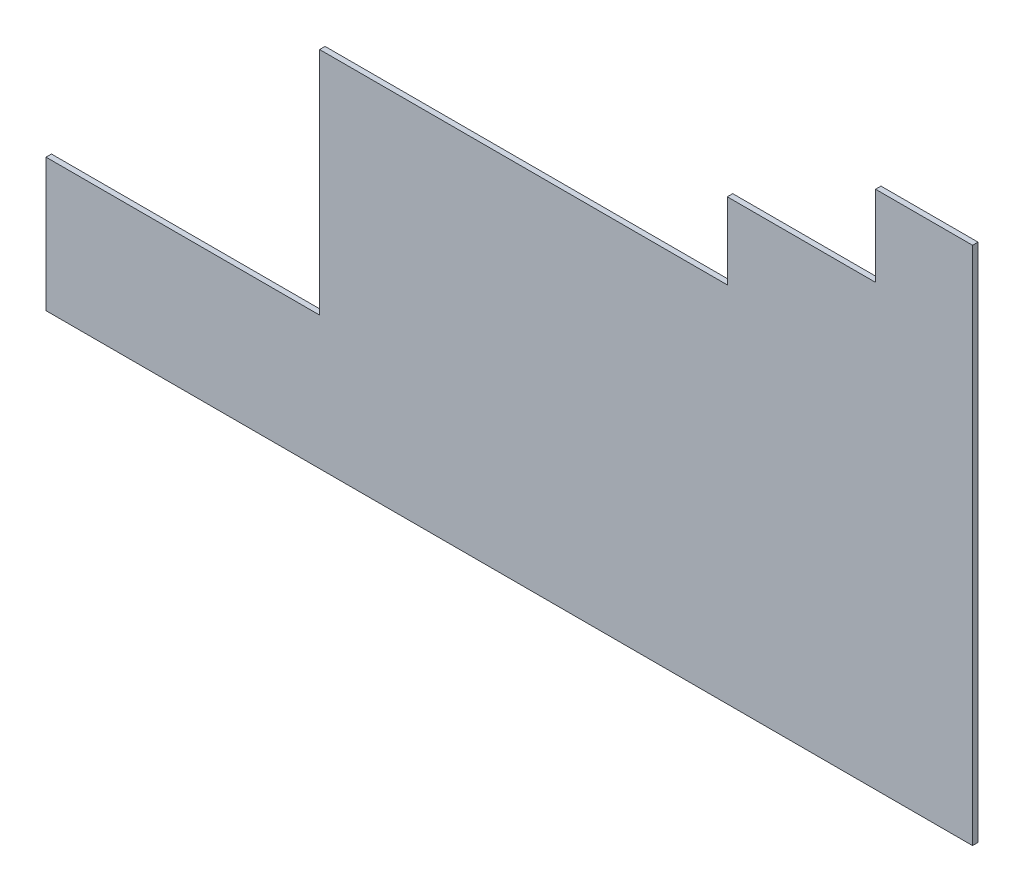
ISO-10303-21;
HEADER;
FILE_DESCRIPTION(('STEP AP214'),'2;1');
FILE_NAME('part.step','',(''),(''),'','','');
FILE_SCHEMA(('AUTOMOTIVE_DESIGN { 1 0 10303 214 1 1 1 1 }'));
ENDSEC;
DATA;
#1=APPLICATION_CONTEXT('core data for automotive mechanical design processes');
#2=APPLICATION_PROTOCOL_DEFINITION('international standard','automotive_design',2000,#1);
#3=PRODUCT_CONTEXT('',#1,'mechanical');
#4=PRODUCT('Part','Part','',(#3));
#5=PRODUCT_RELATED_PRODUCT_CATEGORY('part','',(#4));
#6=PRODUCT_DEFINITION_FORMATION('','',#4);
#7=PRODUCT_DEFINITION_CONTEXT('part definition',#1,'design');
#8=PRODUCT_DEFINITION('design','',#6,#7);
#9=PRODUCT_DEFINITION_SHAPE('','',#8);
#10=(LENGTH_UNIT() NAMED_UNIT(*) SI_UNIT(.MILLI.,.METRE.));
#11=(NAMED_UNIT(*) PLANE_ANGLE_UNIT() SI_UNIT($,.RADIAN.));
#12=(NAMED_UNIT(*) SI_UNIT($,.STERADIAN.) SOLID_ANGLE_UNIT());
#13=UNCERTAINTY_MEASURE_WITH_UNIT(LENGTH_MEASURE(1.E-05),#10,'distance_accuracy_value','');
#14=(GEOMETRIC_REPRESENTATION_CONTEXT(3) GLOBAL_UNCERTAINTY_ASSIGNED_CONTEXT((#13)) GLOBAL_UNIT_ASSIGNED_CONTEXT((#10,
#11,#12)) REPRESENTATION_CONTEXT('',''));
#15=CARTESIAN_POINT('',(0.,0.,0.));
#16=DIRECTION('',(0.,0.,1.));
#17=DIRECTION('',(1.,0.,0.));
#18=AXIS2_PLACEMENT_3D('',#15,#16,#17);
#19=CARTESIAN_POINT('',(0.,0.,-25.));
#20=DIRECTION('',(0.,0.,-1.));
#21=DIRECTION('',(-1.,0.,0.));
#22=AXIS2_PLACEMENT_3D('',#19,#20,#21);
#23=PLANE('',#22);
#24=DIRECTION('',(1.,0.,0.));
#25=VECTOR('',#24,1.);
#26=CARTESIAN_POINT('',(0.,4.99999999999962,-25.));
#27=LINE('',#26,#25);
#28=CARTESIAN_POINT('',(1405.,5.00000000000006,-25.));
#29=VERTEX_POINT('',#28);
#30=CARTESIAN_POINT('',(5655.,5.00000000000032,-25.));
#31=VERTEX_POINT('',#30);
#32=EDGE_CURVE('E118',#29,#31,#27,.T.);
#33=ORIENTED_EDGE('',*,*,#32,.F.);
#34=DIRECTION('',(0.,1.,0.));
#35=VECTOR('',#34,1.);
#36=CARTESIAN_POINT('',(1405.,0.,-25.));
#37=LINE('',#36,#35);
#38=CARTESIAN_POINT('',(1405.,615.,-25.));
#39=VERTEX_POINT('',#38);
#40=EDGE_CURVE('E128',#29,#39,#37,.T.);
#41=ORIENTED_EDGE('',*,*,#40,.T.);
#42=DIRECTION('',(-1.,0.,0.));
#43=VECTOR('',#42,1.);
#44=CARTESIAN_POINT('',(0.,615.,-25.));
#45=LINE('',#44,#43);
#46=CARTESIAN_POINT('',(2660.,615.,-25.));
#47=VERTEX_POINT('',#46);
#48=EDGE_CURVE('E138',#47,#39,#45,.T.);
#49=ORIENTED_EDGE('',*,*,#48,.F.);
#50=DIRECTION('',(0.,1.,0.));
#51=VECTOR('',#50,1.);
#52=CARTESIAN_POINT('',(2660.,0.,-25.));
#53=LINE('',#52,#51);
#54=CARTESIAN_POINT('',(2660.,1670.,-25.));
#55=VERTEX_POINT('',#54);
#56=EDGE_CURVE('E139',#47,#55,#53,.T.);
#57=ORIENTED_EDGE('',*,*,#56,.T.);
#58=DIRECTION('',(1.,0.,0.));
#59=VECTOR('',#58,1.);
#60=CARTESIAN_POINT('',(4300.,1670.,-25.));
#61=LINE('',#60,#59);
#62=CARTESIAN_POINT('',(4530.,1670.,-25.));
#63=VERTEX_POINT('',#62);
#64=EDGE_CURVE('E163',#55,#63,#61,.T.);
#65=ORIENTED_EDGE('',*,*,#64,.T.);
#66=DIRECTION('',(0.,1.,0.));
#67=VECTOR('',#66,1.);
#68=CARTESIAN_POINT('',(4530.,1670.,-25.));
#69=LINE('',#68,#67);
#70=CARTESIAN_POINT('',(4530.,2020.,-25.));
#71=VERTEX_POINT('',#70);
#72=EDGE_CURVE('E141',#63,#71,#69,.T.);
#73=ORIENTED_EDGE('',*,*,#72,.T.);
#74=DIRECTION('',(-1.,0.,0.));
#75=VECTOR('',#74,1.);
#76=CARTESIAN_POINT('',(2935.,2020.,-25.));
#77=LINE('',#76,#75);
#78=CARTESIAN_POINT('',(5210.,2020.,-25.));
#79=VERTEX_POINT('',#78);
#80=EDGE_CURVE('E177',#79,#71,#77,.T.);
#81=ORIENTED_EDGE('',*,*,#80,.F.);
#82=DIRECTION('',(0.,1.,0.));
#83=VECTOR('',#82,1.);
#84=CARTESIAN_POINT('',(5210.,2515.,-25.));
#85=LINE('',#84,#83);
#86=CARTESIAN_POINT('',(5210.,2390.,-25.));
#87=VERTEX_POINT('',#86);
#88=EDGE_CURVE('E186',#79,#87,#85,.T.);
#89=ORIENTED_EDGE('',*,*,#88,.T.);
#90=DIRECTION('',(1.,0.,0.));
#91=VECTOR('',#90,1.);
#92=CARTESIAN_POINT('',(5210.,2390.,-25.));
#93=LINE('',#92,#91);
#94=CARTESIAN_POINT('',(5655.,2390.,-25.));
#95=VERTEX_POINT('',#94);
#96=EDGE_CURVE('E149',#87,#95,#93,.T.);
#97=ORIENTED_EDGE('',*,*,#96,.T.);
#98=DIRECTION('',(0.,1.,0.));
#99=VECTOR('',#98,1.);
#100=CARTESIAN_POINT('',(5655.,0.,-25.));
#101=LINE('',#100,#99);
#102=EDGE_CURVE('E131',#31,#95,#101,.T.);
#103=ORIENTED_EDGE('',*,*,#102,.F.);
#104=EDGE_LOOP('',(#33,#41,#49,#57,#65,#73,#81,#89,#97,#103));
#105=FACE_BOUND('',#104,.T.);
#106=ADVANCED_FACE('F40',(#105),#23,.T.);
#107=CARTESIAN_POINT('',(0.,0.,0.));
#108=DIRECTION('',(0.,0.,-1.));
#109=DIRECTION('',(-1.,0.,0.));
#110=AXIS2_PLACEMENT_3D('',#107,#108,#109);
#111=PLANE('',#110);
#112=DIRECTION('',(0.,1.,0.));
#113=VECTOR('',#112,1.);
#114=CARTESIAN_POINT('',(1405.,0.,0.));
#115=LINE('',#114,#113);
#116=CARTESIAN_POINT('',(1405.,4.9999999999998,0.));
#117=VERTEX_POINT('',#116);
#118=CARTESIAN_POINT('',(1405.,615.,0.));
#119=VERTEX_POINT('',#118);
#120=EDGE_CURVE('E168',#117,#119,#115,.T.);
#121=ORIENTED_EDGE('',*,*,#120,.F.);
#122=DIRECTION('',(1.,0.,0.));
#123=VECTOR('',#122,1.);
#124=CARTESIAN_POINT('',(0.,4.99999999999962,0.));
#125=LINE('',#124,#123);
#126=CARTESIAN_POINT('',(5655.,5.00000000000032,0.));
#127=VERTEX_POINT('',#126);
#128=EDGE_CURVE('E55',#117,#127,#125,.T.);
#129=ORIENTED_EDGE('',*,*,#128,.T.);
#130=DIRECTION('',(0.,1.,0.));
#131=VECTOR('',#130,1.);
#132=CARTESIAN_POINT('',(5655.,0.,0.));
#133=LINE('',#132,#131);
#134=CARTESIAN_POINT('',(5655.,2390.,0.));
#135=VERTEX_POINT('',#134);
#136=EDGE_CURVE('E132',#127,#135,#133,.T.);
#137=ORIENTED_EDGE('',*,*,#136,.T.);
#138=DIRECTION('',(-1.,0.,0.));
#139=VECTOR('',#138,1.);
#140=CARTESIAN_POINT('',(0.,2390.,0.));
#141=LINE('',#140,#139);
#142=CARTESIAN_POINT('',(5210.,2390.,0.));
#143=VERTEX_POINT('',#142);
#144=EDGE_CURVE('E155',#135,#143,#141,.T.);
#145=ORIENTED_EDGE('',*,*,#144,.T.);
#146=DIRECTION('',(0.,-1.,0.));
#147=VECTOR('',#146,1.);
#148=CARTESIAN_POINT('',(5210.,0.,0.));
#149=LINE('',#148,#147);
#150=CARTESIAN_POINT('',(5210.,2020.,0.));
#151=VERTEX_POINT('',#150);
#152=EDGE_CURVE('E175',#143,#151,#149,.T.);
#153=ORIENTED_EDGE('',*,*,#152,.T.);
#154=DIRECTION('',(-1.,0.,0.));
#155=VECTOR('',#154,1.);
#156=CARTESIAN_POINT('',(2935.,2020.,0.));
#157=LINE('',#156,#155);
#158=CARTESIAN_POINT('',(4530.,2020.,0.));
#159=VERTEX_POINT('',#158);
#160=EDGE_CURVE('E178',#151,#159,#157,.T.);
#161=ORIENTED_EDGE('',*,*,#160,.T.);
#162=DIRECTION('',(0.,-1.,0.));
#163=VECTOR('',#162,1.);
#164=CARTESIAN_POINT('',(4530.,0.,0.));
#165=LINE('',#164,#163);
#166=CARTESIAN_POINT('',(4530.,1670.,0.));
#167=VERTEX_POINT('',#166);
#168=EDGE_CURVE('E172',#159,#167,#165,.T.);
#169=ORIENTED_EDGE('',*,*,#168,.T.);
#170=DIRECTION('',(-1.,0.,0.));
#171=VECTOR('',#170,1.);
#172=CARTESIAN_POINT('',(-2.55734131189519E-13,1670.,0.));
#173=LINE('',#172,#171);
#174=CARTESIAN_POINT('',(2660.,1670.,0.));
#175=VERTEX_POINT('',#174);
#176=EDGE_CURVE('E188',#167,#175,#173,.T.);
#177=ORIENTED_EDGE('',*,*,#176,.T.);
#178=DIRECTION('',(0.,1.,0.));
#179=VECTOR('',#178,1.);
#180=CARTESIAN_POINT('',(2660.,0.,0.));
#181=LINE('',#180,#179);
#182=CARTESIAN_POINT('',(2660.,615.,0.));
#183=VERTEX_POINT('',#182);
#184=EDGE_CURVE('E63',#183,#175,#181,.T.);
#185=ORIENTED_EDGE('',*,*,#184,.F.);
#186=DIRECTION('',(-1.,0.,0.));
#187=VECTOR('',#186,1.);
#188=CARTESIAN_POINT('',(0.,615.,0.));
#189=LINE('',#188,#187);
#190=EDGE_CURVE('E123',#183,#119,#189,.T.);
#191=ORIENTED_EDGE('',*,*,#190,.T.);
#192=EDGE_LOOP('',(#121,#129,#137,#145,#153,#161,#169,#177,#185,#191));
#193=FACE_BOUND('',#192,.T.);
#194=ADVANCED_FACE('F201',(#193),#111,.F.);
#195=CARTESIAN_POINT('',(4300.,1670.,-25.));
#196=DIRECTION('',(0.,-1.,0.));
#197=DIRECTION('',(1.,0.,0.));
#198=AXIS2_PLACEMENT_3D('',#195,#196,#197);
#199=PLANE('',#198);
#200=DIRECTION('',(0.,0.,-1.));
#201=VECTOR('',#200,1.);
#202=CARTESIAN_POINT('',(2660.,1670.,-25.));
#203=LINE('',#202,#201);
#204=EDGE_CURVE('E170',#175,#55,#203,.T.);
#205=ORIENTED_EDGE('',*,*,#204,.F.);
#206=ORIENTED_EDGE('',*,*,#176,.F.);
#207=DIRECTION('',(0.,0.,1.));
#208=VECTOR('',#207,1.);
#209=CARTESIAN_POINT('',(4530.,1670.,-25.));
#210=LINE('',#209,#208);
#211=EDGE_CURVE('E151',#63,#167,#210,.T.);
#212=ORIENTED_EDGE('',*,*,#211,.F.);
#213=ORIENTED_EDGE('',*,*,#64,.F.);
#214=EDGE_LOOP('',(#205,#206,#212,#213));
#215=FACE_BOUND('',#214,.T.);
#216=ADVANCED_FACE('F195',(#215),#199,.F.);
#217=CARTESIAN_POINT('',(2935.,2020.,-25.));
#218=DIRECTION('',(0.,1.,0.));
#219=DIRECTION('',(0.,0.,1.));
#220=AXIS2_PLACEMENT_3D('',#217,#218,#219);
#221=PLANE('',#220);
#222=DIRECTION('',(0.,0.,1.));
#223=VECTOR('',#222,1.);
#224=CARTESIAN_POINT('',(4530.,2020.,-25.));
#225=LINE('',#224,#223);
#226=EDGE_CURVE('E156',#71,#159,#225,.T.);
#227=ORIENTED_EDGE('',*,*,#226,.T.);
#228=ORIENTED_EDGE('',*,*,#160,.F.);
#229=DIRECTION('',(0.,0.,1.));
#230=VECTOR('',#229,1.);
#231=CARTESIAN_POINT('',(5210.,2020.,-25.));
#232=LINE('',#231,#230);
#233=EDGE_CURVE('E181',#79,#151,#232,.T.);
#234=ORIENTED_EDGE('',*,*,#233,.F.);
#235=ORIENTED_EDGE('',*,*,#80,.T.);
#236=EDGE_LOOP('',(#227,#228,#234,#235));
#237=FACE_BOUND('',#236,.T.);
#238=ADVANCED_FACE('F42',(#237),#221,.T.);
#239=CARTESIAN_POINT('',(5210.,2515.,-25.));
#240=DIRECTION('',(1.,0.,0.));
#241=DIRECTION('',(0.,0.,-1.));
#242=AXIS2_PLACEMENT_3D('',#239,#240,#241);
#243=PLANE('',#242);
#244=ORIENTED_EDGE('',*,*,#152,.F.);
#245=DIRECTION('',(0.,0.,1.));
#246=VECTOR('',#245,1.);
#247=CARTESIAN_POINT('',(5210.,2390.,-25.));
#248=LINE('',#247,#246);
#249=EDGE_CURVE('E152',#87,#143,#248,.T.);
#250=ORIENTED_EDGE('',*,*,#249,.F.);
#251=ORIENTED_EDGE('',*,*,#88,.F.);
#252=ORIENTED_EDGE('',*,*,#233,.T.);
#253=EDGE_LOOP('',(#244,#250,#251,#252));
#254=FACE_BOUND('',#253,.T.);
#255=ADVANCED_FACE('F207',(#254),#243,.F.);
#256=CARTESIAN_POINT('',(4530.,1670.,-25.));
#257=DIRECTION('',(1.,0.,0.));
#258=DIRECTION('',(0.,0.,-1.));
#259=AXIS2_PLACEMENT_3D('',#256,#257,#258);
#260=PLANE('',#259);
#261=ORIENTED_EDGE('',*,*,#226,.F.);
#262=ORIENTED_EDGE('',*,*,#72,.F.);
#263=ORIENTED_EDGE('',*,*,#211,.T.);
#264=ORIENTED_EDGE('',*,*,#168,.F.);
#265=EDGE_LOOP('',(#261,#262,#263,#264));
#266=FACE_BOUND('',#265,.T.);
#267=ADVANCED_FACE('F197',(#266),#260,.F.);
#268=CARTESIAN_POINT('',(5210.,2390.,-25.));
#269=DIRECTION('',(0.,-1.,0.));
#270=DIRECTION('',(0.,0.,-1.));
#271=AXIS2_PLACEMENT_3D('',#268,#269,#270);
#272=PLANE('',#271);
#273=ORIENTED_EDGE('',*,*,#144,.F.);
#274=DIRECTION('',(0.,0.,-1.));
#275=VECTOR('',#274,1.);
#276=CARTESIAN_POINT('',(5655.,2390.,-25.));
#277=LINE('',#276,#275);
#278=EDGE_CURVE('E11',#135,#95,#277,.T.);
#279=ORIENTED_EDGE('',*,*,#278,.T.);
#280=ORIENTED_EDGE('',*,*,#96,.F.);
#281=ORIENTED_EDGE('',*,*,#249,.T.);
#282=EDGE_LOOP('',(#273,#279,#280,#281));
#283=FACE_BOUND('',#282,.T.);
#284=ADVANCED_FACE('F210',(#283),#272,.F.);
#285=CARTESIAN_POINT('',(0.,615.,-25.000025));
#286=DIRECTION('',(0.,-1.,0.));
#287=DIRECTION('',(0.,0.,-1.));
#288=AXIS2_PLACEMENT_3D('',#285,#286,#287);
#289=PLANE('',#288);
#290=ORIENTED_EDGE('',*,*,#48,.T.);
#291=DIRECTION('',(0.,0.,1.));
#292=VECTOR('',#291,1.);
#293=CARTESIAN_POINT('',(1405.,615.,-25.000025));
#294=LINE('',#293,#292);
#295=EDGE_CURVE('E137',#39,#119,#294,.T.);
#296=ORIENTED_EDGE('',*,*,#295,.T.);
#297=ORIENTED_EDGE('',*,*,#190,.F.);
#298=DIRECTION('',(0.,0.,1.));
#299=VECTOR('',#298,1.);
#300=CARTESIAN_POINT('',(2660.,615.,-25.000025));
#301=LINE('',#300,#299);
#302=EDGE_CURVE('E217',#47,#183,#301,.T.);
#303=ORIENTED_EDGE('',*,*,#302,.F.);
#304=EDGE_LOOP('',(#290,#296,#297,#303));
#305=FACE_BOUND('',#304,.T.);
#306=ADVANCED_FACE('F220',(#305),#289,.F.);
#307=CARTESIAN_POINT('',(1405.,0.,-25.000025));
#308=DIRECTION('',(-1.,0.,0.));
#309=DIRECTION('',(0.,0.,1.));
#310=AXIS2_PLACEMENT_3D('',#307,#308,#309);
#311=PLANE('',#310);
#312=DIRECTION('',(0.,0.,-1.));
#313=VECTOR('',#312,1.);
#314=CARTESIAN_POINT('',(1405.,4.9999999999998,-25.000025));
#315=LINE('',#314,#313);
#316=EDGE_CURVE('E48',#117,#29,#315,.T.);
#317=ORIENTED_EDGE('',*,*,#316,.F.);
#318=ORIENTED_EDGE('',*,*,#120,.T.);
#319=ORIENTED_EDGE('',*,*,#295,.F.);
#320=ORIENTED_EDGE('',*,*,#40,.F.);
#321=EDGE_LOOP('',(#317,#318,#319,#320));
#322=FACE_BOUND('',#321,.T.);
#323=ADVANCED_FACE('F135',(#322),#311,.T.);
#324=CARTESIAN_POINT('',(2660.,0.,-25.000025));
#325=DIRECTION('',(-1.,0.,0.));
#326=DIRECTION('',(0.,0.,1.));
#327=AXIS2_PLACEMENT_3D('',#324,#325,#326);
#328=PLANE('',#327);
#329=ORIENTED_EDGE('',*,*,#302,.T.);
#330=ORIENTED_EDGE('',*,*,#184,.T.);
#331=ORIENTED_EDGE('',*,*,#204,.T.);
#332=ORIENTED_EDGE('',*,*,#56,.F.);
#333=EDGE_LOOP('',(#329,#330,#331,#332));
#334=FACE_BOUND('',#333,.T.);
#335=ADVANCED_FACE('F222',(#334),#328,.T.);
#336=CARTESIAN_POINT('',(5655.,0.,-25.000025));
#337=DIRECTION('',(-1.,0.,0.));
#338=DIRECTION('',(0.,0.,1.));
#339=AXIS2_PLACEMENT_3D('',#336,#337,#338);
#340=PLANE('',#339);
#341=ORIENTED_EDGE('',*,*,#102,.T.);
#342=ORIENTED_EDGE('',*,*,#278,.F.);
#343=ORIENTED_EDGE('',*,*,#136,.F.);
#344=DIRECTION('',(0.,0.,1.));
#345=VECTOR('',#344,1.);
#346=CARTESIAN_POINT('',(5655.,5.00000000000032,-25.000025));
#347=LINE('',#346,#345);
#348=EDGE_CURVE('E336',#31,#127,#347,.T.);
#349=ORIENTED_EDGE('',*,*,#348,.F.);
#350=EDGE_LOOP('',(#341,#342,#343,#349));
#351=FACE_BOUND('',#350,.T.);
#352=ADVANCED_FACE('F212',(#351),#340,.F.);
#353=CARTESIAN_POINT('',(0.,4.99999999999962,-25.000025));
#354=DIRECTION('',(0.,1.,0.));
#355=DIRECTION('',(-1.,0.,0.));
#356=AXIS2_PLACEMENT_3D('',#353,#354,#355);
#357=PLANE('',#356);
#358=ORIENTED_EDGE('',*,*,#32,.T.);
#359=ORIENTED_EDGE('',*,*,#348,.T.);
#360=ORIENTED_EDGE('',*,*,#128,.F.);
#361=ORIENTED_EDGE('',*,*,#316,.T.);
#362=EDGE_LOOP('',(#358,#359,#360,#361));
#363=FACE_BOUND('',#362,.T.);
#364=ADVANCED_FACE('F117',(#363),#357,.F.);
#365=CLOSED_SHELL('',(#106,#194,#216,#238,#255,#267,#284,#306,#323,#335,#352,#364));
#366=MANIFOLD_SOLID_BREP('B2',#365);
#367=ADVANCED_BREP_SHAPE_REPRESENTATION('',(#18,#366),#14);
#368=SHAPE_DEFINITION_REPRESENTATION(#9,#367);
ENDSEC;
END-ISO-10303-21;
